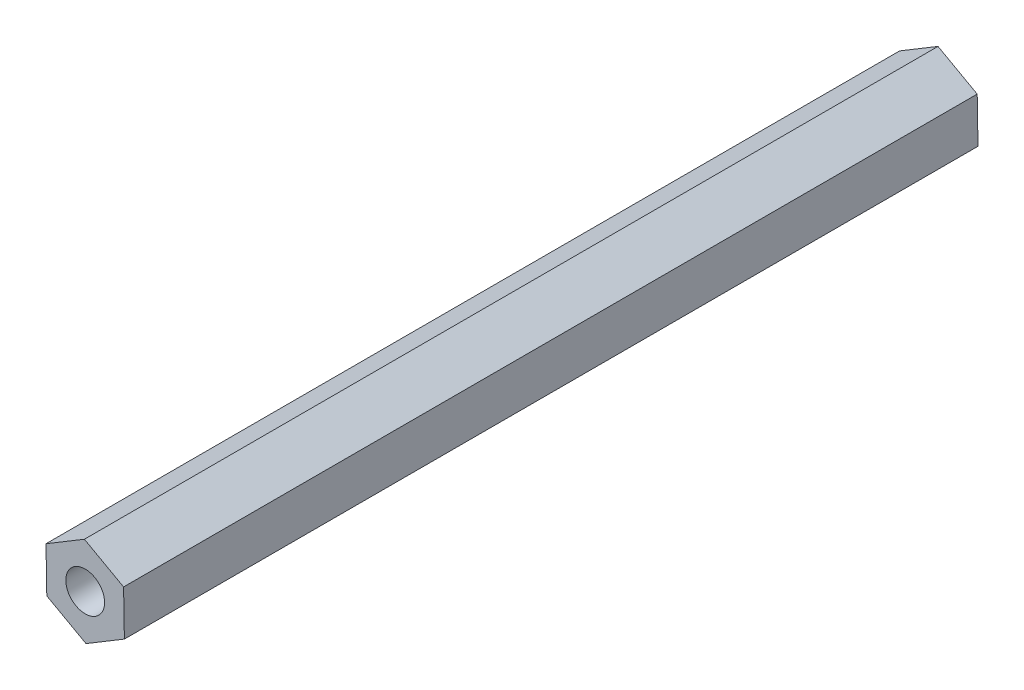
ISO-10303-21;
HEADER;
FILE_DESCRIPTION(('STEP AP214'),'2;1');
FILE_NAME('part.step','',(''),(''),'','','');
FILE_SCHEMA(('AUTOMOTIVE_DESIGN { 1 0 10303 214 1 1 1 1 }'));
ENDSEC;
DATA;
#1=APPLICATION_CONTEXT('core data for automotive mechanical design processes');
#2=APPLICATION_PROTOCOL_DEFINITION('international standard','automotive_design',2000,#1);
#3=PRODUCT_CONTEXT('',#1,'mechanical');
#4=PRODUCT('Part','Part','',(#3));
#5=PRODUCT_RELATED_PRODUCT_CATEGORY('part','',(#4));
#6=PRODUCT_DEFINITION_FORMATION('','',#4);
#7=PRODUCT_DEFINITION_CONTEXT('part definition',#1,'design');
#8=PRODUCT_DEFINITION('design','',#6,#7);
#9=PRODUCT_DEFINITION_SHAPE('','',#8);
#10=(LENGTH_UNIT() NAMED_UNIT(*) SI_UNIT(.MILLI.,.METRE.));
#11=(NAMED_UNIT(*) PLANE_ANGLE_UNIT() SI_UNIT($,.RADIAN.));
#12=(NAMED_UNIT(*) SI_UNIT($,.STERADIAN.) SOLID_ANGLE_UNIT());
#13=UNCERTAINTY_MEASURE_WITH_UNIT(LENGTH_MEASURE(1.E-05),#10,'distance_accuracy_value','');
#14=(GEOMETRIC_REPRESENTATION_CONTEXT(3) GLOBAL_UNCERTAINTY_ASSIGNED_CONTEXT((#13)) GLOBAL_UNIT_ASSIGNED_CONTEXT((#10,
#11,#12)) REPRESENTATION_CONTEXT('',''));
#15=CARTESIAN_POINT('',(0.,0.,0.));
#16=DIRECTION('',(0.,0.,1.));
#17=DIRECTION('',(1.,0.,0.));
#18=AXIS2_PLACEMENT_3D('',#15,#16,#17);
#19=CARTESIAN_POINT('',(6.41370307800274,-3.55355401824026,-69.85));
#20=DIRECTION('',(0.999844304765389,0.0176455724819242,0.));
#21=DIRECTION('',(-0.0176455724819242,0.99984430476539,0.));
#22=AXIS2_PLACEMENT_3D('',#19,#20,#21);
#23=PLANE('',#22);
#24=DIRECTION('',(0.,0.,1.));
#25=VECTOR('',#24,1.);
#26=CARTESIAN_POINT('',(6.2843195925177,3.77765278876069,-69.85));
#27=LINE('',#26,#25);
#28=CARTESIAN_POINT('',(6.2843195925177,3.77765278876069,-69.85));
#29=VERTEX_POINT('',#28);
#30=CARTESIAN_POINT('',(6.2843195925177,3.77765278876069,69.85));
#31=VERTEX_POINT('',#30);
#32=EDGE_CURVE('E36',#29,#31,#27,.T.);
#33=ORIENTED_EDGE('',*,*,#32,.T.);
#34=DIRECTION('',(-0.0176455724819242,0.99984430476539,0.));
#35=VECTOR('',#34,1.);
#36=CARTESIAN_POINT('',(6.41370307800274,-3.55355401824026,69.85));
#37=LINE('',#36,#35);
#38=CARTESIAN_POINT('',(6.41370307800274,-3.55355401824026,69.85));
#39=VERTEX_POINT('',#38);
#40=EDGE_CURVE('E85',#39,#31,#37,.T.);
#41=ORIENTED_EDGE('',*,*,#40,.F.);
#42=DIRECTION('',(0.,0.,1.));
#43=VECTOR('',#42,1.);
#44=CARTESIAN_POINT('',(6.41370307800274,-3.55355401824026,-69.85));
#45=LINE('',#44,#43);
#46=CARTESIAN_POINT('',(6.41370307800274,-3.55355401824026,-69.85));
#47=VERTEX_POINT('',#46);
#48=EDGE_CURVE('E11',#47,#39,#45,.T.);
#49=ORIENTED_EDGE('',*,*,#48,.F.);
#50=DIRECTION('',(-0.0176455724819242,0.99984430476539,0.));
#51=VECTOR('',#50,1.);
#52=CARTESIAN_POINT('',(6.41370307800274,-3.55355401824026,-69.85));
#53=LINE('',#52,#51);
#54=EDGE_CURVE('E86',#47,#29,#53,.T.);
#55=ORIENTED_EDGE('',*,*,#54,.T.);
#56=EDGE_LOOP('',(#33,#41,#49,#55));
#57=FACE_BOUND('',#56,.T.);
#58=ADVANCED_FACE('F33',(#57),#23,.T.);
#59=CARTESIAN_POINT('',(0.129383485485038,-7.33120680700095,-69.85));
#60=DIRECTION('',(0.515203666416361,-0.857067781515056,0.));
#61=DIRECTION('',(0.857067781515056,0.515203666416361,0.));
#62=AXIS2_PLACEMENT_3D('',#59,#60,#61);
#63=PLANE('',#62);
#64=ORIENTED_EDGE('',*,*,#48,.T.);
#65=DIRECTION('',(0.857067781515056,0.515203666416361,0.));
#66=VECTOR('',#65,1.);
#67=CARTESIAN_POINT('',(0.129383485485038,-7.33120680700095,69.85));
#68=LINE('',#67,#66);
#69=CARTESIAN_POINT('',(0.129383485485038,-7.33120680700095,69.85));
#70=VERTEX_POINT('',#69);
#71=EDGE_CURVE('E104',#70,#39,#68,.T.);
#72=ORIENTED_EDGE('',*,*,#71,.F.);
#73=DIRECTION('',(0.,0.,1.));
#74=VECTOR('',#73,1.);
#75=CARTESIAN_POINT('',(0.129383485485038,-7.33120680700095,-69.85));
#76=LINE('',#75,#74);
#77=CARTESIAN_POINT('',(0.129383485485038,-7.33120680700095,-69.85));
#78=VERTEX_POINT('',#77);
#79=EDGE_CURVE('E41',#78,#70,#76,.T.);
#80=ORIENTED_EDGE('',*,*,#79,.F.);
#81=DIRECTION('',(0.857067781515056,0.515203666416361,0.));
#82=VECTOR('',#81,1.);
#83=CARTESIAN_POINT('',(0.129383485485038,-7.33120680700095,-69.85));
#84=LINE('',#83,#82);
#85=EDGE_CURVE('E91',#78,#47,#84,.T.);
#86=ORIENTED_EDGE('',*,*,#85,.T.);
#87=EDGE_LOOP('',(#64,#72,#80,#86));
#88=FACE_BOUND('',#87,.T.);
#89=ADVANCED_FACE('F150',(#88),#63,.T.);
#90=CARTESIAN_POINT('',(-6.2843195925177,-3.77765278876069,-69.85));
#91=DIRECTION('',(-0.484640638349029,-0.87471335399698,0.));
#92=DIRECTION('',(0.87471335399698,-0.484640638349029,0.));
#93=AXIS2_PLACEMENT_3D('',#90,#91,#92);
#94=PLANE('',#93);
#95=ORIENTED_EDGE('',*,*,#79,.T.);
#96=DIRECTION('',(0.87471335399698,-0.484640638349029,0.));
#97=VECTOR('',#96,1.);
#98=CARTESIAN_POINT('',(-6.2843195925177,-3.77765278876069,69.85));
#99=LINE('',#98,#97);
#100=CARTESIAN_POINT('',(-6.2843195925177,-3.77765278876069,69.85));
#101=VERTEX_POINT('',#100);
#102=EDGE_CURVE('E114',#101,#70,#99,.T.);
#103=ORIENTED_EDGE('',*,*,#102,.F.);
#104=DIRECTION('',(0.,0.,1.));
#105=VECTOR('',#104,1.);
#106=CARTESIAN_POINT('',(-6.2843195925177,-3.77765278876069,-69.85));
#107=LINE('',#106,#105);
#108=CARTESIAN_POINT('',(-6.2843195925177,-3.77765278876069,-69.85));
#109=VERTEX_POINT('',#108);
#110=EDGE_CURVE('E133',#109,#101,#107,.T.);
#111=ORIENTED_EDGE('',*,*,#110,.F.);
#112=DIRECTION('',(0.87471335399698,-0.484640638349029,0.));
#113=VECTOR('',#112,1.);
#114=CARTESIAN_POINT('',(-6.2843195925177,-3.77765278876069,-69.85));
#115=LINE('',#114,#113);
#116=EDGE_CURVE('E129',#109,#78,#115,.T.);
#117=ORIENTED_EDGE('',*,*,#116,.T.);
#118=EDGE_LOOP('',(#95,#103,#111,#117));
#119=FACE_BOUND('',#118,.T.);
#120=ADVANCED_FACE('F146',(#119),#94,.T.);
#121=CARTESIAN_POINT('',(-6.41370307800274,3.55355401824025,-69.85));
#122=DIRECTION('',(-0.999844304765389,-0.0176455724819242,0.));
#123=DIRECTION('',(0.0176455724819242,-0.99984430476539,0.));
#124=AXIS2_PLACEMENT_3D('',#121,#122,#123);
#125=PLANE('',#124);
#126=ORIENTED_EDGE('',*,*,#110,.T.);
#127=DIRECTION('',(0.0176455724819242,-0.99984430476539,0.));
#128=VECTOR('',#127,1.);
#129=CARTESIAN_POINT('',(-6.41370307800274,3.55355401824025,69.85));
#130=LINE('',#129,#128);
#131=CARTESIAN_POINT('',(-6.41370307800274,3.55355401824025,69.85));
#132=VERTEX_POINT('',#131);
#133=EDGE_CURVE('E111',#132,#101,#130,.T.);
#134=ORIENTED_EDGE('',*,*,#133,.F.);
#135=DIRECTION('',(0.,0.,1.));
#136=VECTOR('',#135,1.);
#137=CARTESIAN_POINT('',(-6.41370307800274,3.55355401824025,-69.85));
#138=LINE('',#137,#136);
#139=CARTESIAN_POINT('',(-6.41370307800274,3.55355401824025,-69.85));
#140=VERTEX_POINT('',#139);
#141=EDGE_CURVE('E135',#140,#132,#138,.T.);
#142=ORIENTED_EDGE('',*,*,#141,.F.);
#143=DIRECTION('',(0.0176455724819242,-0.99984430476539,0.));
#144=VECTOR('',#143,1.);
#145=CARTESIAN_POINT('',(-6.41370307800274,3.55355401824025,-69.85));
#146=LINE('',#145,#144);
#147=EDGE_CURVE('E126',#140,#109,#146,.T.);
#148=ORIENTED_EDGE('',*,*,#147,.T.);
#149=EDGE_LOOP('',(#126,#134,#142,#148));
#150=FACE_BOUND('',#149,.T.);
#151=ADVANCED_FACE('F143',(#150),#125,.T.);
#152=CARTESIAN_POINT('',(-0.129383485485037,7.33120680700095,-69.85));
#153=DIRECTION('',(-0.515203666416361,0.857067781515056,0.));
#154=DIRECTION('',(-0.857067781515056,-0.515203666416361,0.));
#155=AXIS2_PLACEMENT_3D('',#152,#153,#154);
#156=PLANE('',#155);
#157=ORIENTED_EDGE('',*,*,#141,.T.);
#158=DIRECTION('',(-0.857067781515056,-0.515203666416361,0.));
#159=VECTOR('',#158,1.);
#160=CARTESIAN_POINT('',(-0.129383485485037,7.33120680700095,69.85));
#161=LINE('',#160,#159);
#162=CARTESIAN_POINT('',(-0.129383485485037,7.33120680700095,69.85));
#163=VERTEX_POINT('',#162);
#164=EDGE_CURVE('E98',#163,#132,#161,.T.);
#165=ORIENTED_EDGE('',*,*,#164,.F.);
#166=DIRECTION('',(0.,0.,1.));
#167=VECTOR('',#166,1.);
#168=CARTESIAN_POINT('',(-0.129383485485037,7.33120680700095,-69.85));
#169=LINE('',#168,#167);
#170=CARTESIAN_POINT('',(-0.129383485485037,7.33120680700095,-69.85));
#171=VERTEX_POINT('',#170);
#172=EDGE_CURVE('E90',#171,#163,#169,.T.);
#173=ORIENTED_EDGE('',*,*,#172,.F.);
#174=DIRECTION('',(-0.857067781515056,-0.515203666416361,0.));
#175=VECTOR('',#174,1.);
#176=CARTESIAN_POINT('',(-0.129383485485037,7.33120680700095,-69.85));
#177=LINE('',#176,#175);
#178=EDGE_CURVE('E123',#171,#140,#177,.T.);
#179=ORIENTED_EDGE('',*,*,#178,.T.);
#180=EDGE_LOOP('',(#157,#165,#173,#179));
#181=FACE_BOUND('',#180,.T.);
#182=ADVANCED_FACE('F137',(#181),#156,.T.);
#183=CARTESIAN_POINT('',(6.2843195925177,3.77765278876069,-69.85));
#184=DIRECTION('',(0.484640638349029,0.87471335399698,0.));
#185=DIRECTION('',(-0.87471335399698,0.484640638349029,0.));
#186=AXIS2_PLACEMENT_3D('',#183,#184,#185);
#187=PLANE('',#186);
#188=ORIENTED_EDGE('',*,*,#172,.T.);
#189=DIRECTION('',(-0.87471335399698,0.484640638349029,0.));
#190=VECTOR('',#189,1.);
#191=CARTESIAN_POINT('',(6.2843195925177,3.77765278876069,69.85));
#192=LINE('',#191,#190);
#193=EDGE_CURVE('E93',#31,#163,#192,.T.);
#194=ORIENTED_EDGE('',*,*,#193,.F.);
#195=ORIENTED_EDGE('',*,*,#32,.F.);
#196=DIRECTION('',(-0.87471335399698,0.484640638349029,0.));
#197=VECTOR('',#196,1.);
#198=CARTESIAN_POINT('',(6.2843195925177,3.77765278876069,-69.85));
#199=LINE('',#198,#197);
#200=EDGE_CURVE('E121',#29,#171,#199,.T.);
#201=ORIENTED_EDGE('',*,*,#200,.T.);
#202=EDGE_LOOP('',(#188,#194,#195,#201));
#203=FACE_BOUND('',#202,.T.);
#204=ADVANCED_FACE('F94',(#203),#187,.T.);
#205=CARTESIAN_POINT('',(0.,0.,-69.85));
#206=DIRECTION('',(0.,0.,1.));
#207=DIRECTION('',(1.,0.,0.));
#208=AXIS2_PLACEMENT_3D('',#205,#206,#207);
#209=PLANE('',#208);
#210=CARTESIAN_POINT('',(0.,0.,-69.85));
#211=DIRECTION('',(0.,0.,1.));
#212=DIRECTION('',(1.,0.,0.));
#213=AXIS2_PLACEMENT_3D('',#210,#211,#212);
#214=CIRCLE('',#213,3.175);
#215=CARTESIAN_POINT('',(3.175,0.,-69.85));
#216=VERTEX_POINT('',#215);
#217=EDGE_CURVE('E117',#216,#216,#214,.T.);
#218=ORIENTED_EDGE('',*,*,#217,.T.);
#219=EDGE_LOOP('',(#218));
#220=FACE_BOUND('',#219,.T.);
#221=ORIENTED_EDGE('',*,*,#54,.F.);
#222=ORIENTED_EDGE('',*,*,#85,.F.);
#223=ORIENTED_EDGE('',*,*,#116,.F.);
#224=ORIENTED_EDGE('',*,*,#147,.F.);
#225=ORIENTED_EDGE('',*,*,#178,.F.);
#226=ORIENTED_EDGE('',*,*,#200,.F.);
#227=EDGE_LOOP('',(#221,#222,#223,#224,#225,#226));
#228=FACE_BOUND('',#227,.T.);
#229=ADVANCED_FACE('F149',(#220,#228),#209,.F.);
#230=CARTESIAN_POINT('',(0.,0.,-69.85));
#231=DIRECTION('',(0.,0.,1.));
#232=DIRECTION('',(1.,0.,0.));
#233=AXIS2_PLACEMENT_3D('',#230,#231,#232);
#234=CYLINDRICAL_SURFACE('',#233,3.175);
#235=ORIENTED_EDGE('',*,*,#217,.F.);
#236=EDGE_LOOP('',(#235));
#237=FACE_BOUND('',#236,.T.);
#238=CARTESIAN_POINT('',(0.,0.,69.85));
#239=DIRECTION('',(0.,0.,1.));
#240=DIRECTION('',(1.,0.,0.));
#241=AXIS2_PLACEMENT_3D('',#238,#239,#240);
#242=CIRCLE('',#241,3.175);
#243=CARTESIAN_POINT('',(3.175,0.,69.85));
#244=VERTEX_POINT('',#243);
#245=EDGE_CURVE('E105',#244,#244,#242,.T.);
#246=ORIENTED_EDGE('',*,*,#245,.T.);
#247=EDGE_LOOP('',(#246));
#248=FACE_BOUND('',#247,.T.);
#249=ADVANCED_FACE('F168',(#237,#248),#234,.F.);
#250=CARTESIAN_POINT('',(0.,0.,69.85));
#251=DIRECTION('',(0.,0.,1.));
#252=DIRECTION('',(1.,0.,0.));
#253=AXIS2_PLACEMENT_3D('',#250,#251,#252);
#254=PLANE('',#253);
#255=ORIENTED_EDGE('',*,*,#40,.T.);
#256=ORIENTED_EDGE('',*,*,#193,.T.);
#257=ORIENTED_EDGE('',*,*,#164,.T.);
#258=ORIENTED_EDGE('',*,*,#133,.T.);
#259=ORIENTED_EDGE('',*,*,#102,.T.);
#260=ORIENTED_EDGE('',*,*,#71,.T.);
#261=EDGE_LOOP('',(#255,#256,#257,#258,#259,#260));
#262=FACE_BOUND('',#261,.T.);
#263=ORIENTED_EDGE('',*,*,#245,.F.);
#264=EDGE_LOOP('',(#263));
#265=FACE_BOUND('',#264,.T.);
#266=ADVANCED_FACE('F101',(#262,#265),#254,.T.);
#267=CLOSED_SHELL('',(#58,#89,#120,#151,#182,#204,#229,#249,#266));
#268=MANIFOLD_SOLID_BREP('B2',#267);
#269=ADVANCED_BREP_SHAPE_REPRESENTATION('',(#18,#268),#14);
#270=SHAPE_DEFINITION_REPRESENTATION(#9,#269);
ENDSEC;
END-ISO-10303-21;
